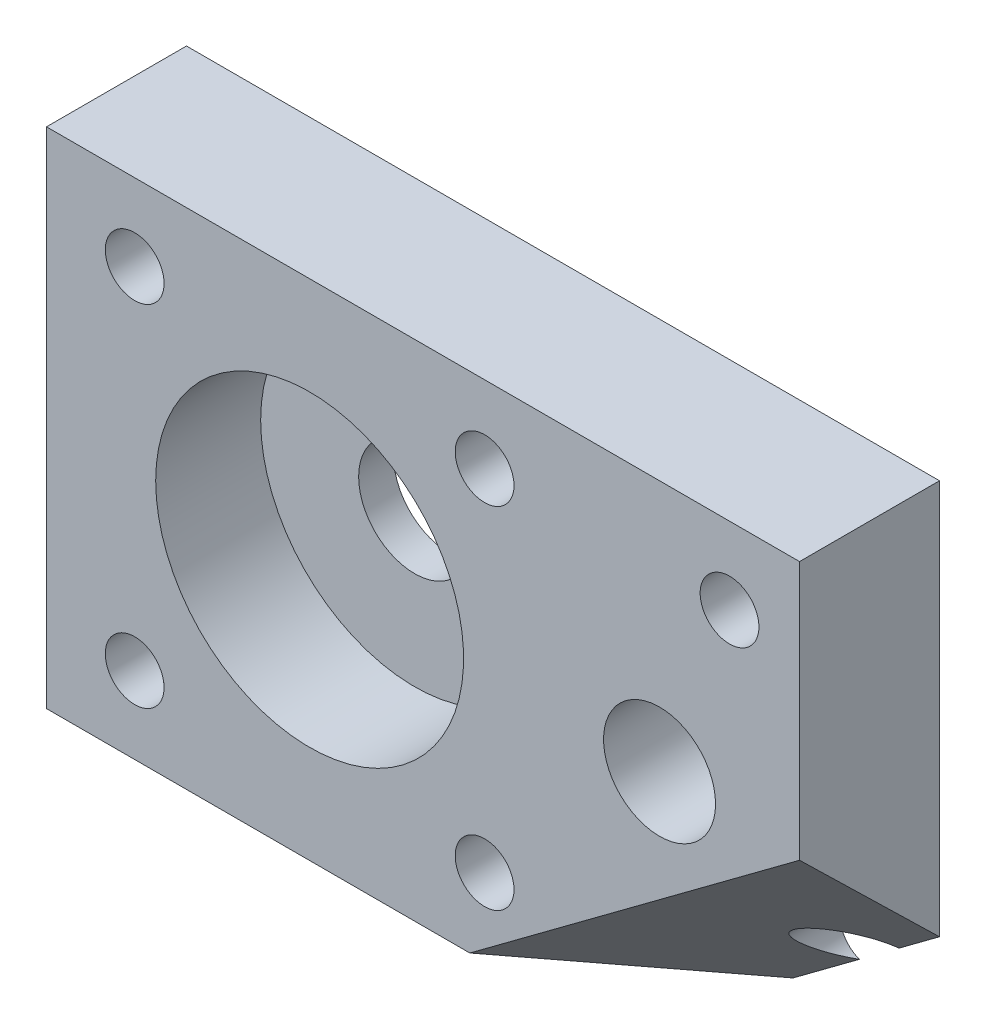
ISO-10303-21;
HEADER;
FILE_DESCRIPTION(('STEP AP214'),'2;1');
FILE_NAME('part.step','',(''),(''),'','','');
FILE_SCHEMA(('AUTOMOTIVE_DESIGN { 1 0 10303 214 1 1 1 1 }'));
ENDSEC;
DATA;
#1=APPLICATION_CONTEXT('core data for automotive mechanical design processes');
#2=APPLICATION_PROTOCOL_DEFINITION('international standard','automotive_design',2000,#1);
#3=PRODUCT_CONTEXT('',#1,'mechanical');
#4=PRODUCT('Part','Part','',(#3));
#5=PRODUCT_RELATED_PRODUCT_CATEGORY('part','',(#4));
#6=PRODUCT_DEFINITION_FORMATION('','',#4);
#7=PRODUCT_DEFINITION_CONTEXT('part definition',#1,'design');
#8=PRODUCT_DEFINITION('design','',#6,#7);
#9=PRODUCT_DEFINITION_SHAPE('','',#8);
#10=(LENGTH_UNIT() NAMED_UNIT(*) SI_UNIT(.MILLI.,.METRE.));
#11=(NAMED_UNIT(*) PLANE_ANGLE_UNIT() SI_UNIT($,.RADIAN.));
#12=(NAMED_UNIT(*) SI_UNIT($,.STERADIAN.) SOLID_ANGLE_UNIT());
#13=UNCERTAINTY_MEASURE_WITH_UNIT(LENGTH_MEASURE(1.E-05),#10,'distance_accuracy_value','');
#14=(GEOMETRIC_REPRESENTATION_CONTEXT(3) GLOBAL_UNCERTAINTY_ASSIGNED_CONTEXT((#13)) GLOBAL_UNIT_ASSIGNED_CONTEXT((#10,
#11,#12)) REPRESENTATION_CONTEXT('',''));
#15=CARTESIAN_POINT('',(0.,0.,0.));
#16=DIRECTION('',(0.,0.,1.));
#17=DIRECTION('',(1.,0.,0.));
#18=AXIS2_PLACEMENT_3D('',#15,#16,#17);
#19=CARTESIAN_POINT('',(0.,0.,-10.));
#20=DIRECTION('',(0.,0.,-1.));
#21=DIRECTION('',(1.,0.,0.));
#22=AXIS2_PLACEMENT_3D('',#19,#20,#21);
#23=PLANE('',#22);
#24=DIRECTION('',(0.802434050763534,0.596740809879152,0.));
#25=VECTOR('',#24,1.);
#26=CARTESIAN_POINT('',(-4.68452105792326,6.29924943319645,-10.));
#27=LINE('',#26,#25);
#28=CARTESIAN_POINT('',(-10.4656978784281,2.,-10.));
#29=VERTEX_POINT('',#28);
#30=CARTESIAN_POINT('',(-5.72172705219318,5.52791732877839,-10.));
#31=VERTEX_POINT('',#30);
#32=EDGE_CURVE('E85',#29,#31,#27,.T.);
#33=ORIENTED_EDGE('',*,*,#32,.F.);
#34=DIRECTION('',(-1.,0.,0.));
#35=VECTOR('',#34,1.);
#36=CARTESIAN_POINT('',(0.,2.,-10.));
#37=LINE('',#36,#35);
#38=CARTESIAN_POINT('',(-53.8,2.,-10.));
#39=VERTEX_POINT('',#38);
#40=EDGE_CURVE('E95',#29,#39,#37,.T.);
#41=ORIENTED_EDGE('',*,*,#40,.T.);
#42=DIRECTION('',(0.,-1.,0.));
#43=VECTOR('',#42,1.);
#44=CARTESIAN_POINT('',(-53.8,0.,-10.));
#45=LINE('',#44,#43);
#46=CARTESIAN_POINT('',(-53.8,38.,-10.));
#47=VERTEX_POINT('',#46);
#48=EDGE_CURVE('E41',#47,#39,#45,.T.);
#49=ORIENTED_EDGE('',*,*,#48,.F.);
#50=DIRECTION('',(1.,0.,0.));
#51=VECTOR('',#50,1.);
#52=CARTESIAN_POINT('',(-53.8,38.,-10.));
#53=LINE('',#52,#51);
#54=CARTESIAN_POINT('',(0.,38.,-10.));
#55=VERTEX_POINT('',#54);
#56=EDGE_CURVE('E235',#47,#55,#53,.T.);
#57=ORIENTED_EDGE('',*,*,#56,.T.);
#58=DIRECTION('',(0.,1.,0.));
#59=VECTOR('',#58,1.);
#60=CARTESIAN_POINT('',(0.,0.,-10.));
#61=LINE('',#60,#59);
#62=CARTESIAN_POINT('',(0.,9.78295614696457,-10.));
#63=VERTEX_POINT('',#62);
#64=EDGE_CURVE('E153',#63,#55,#61,.T.);
#65=ORIENTED_EDGE('',*,*,#64,.F.);
#66=CARTESIAN_POINT('',(-2.90364194199249,7.6236239969705,-10.));
#67=VERTEX_POINT('',#66);
#68=EDGE_CURVE('E102',#67,#63,#27,.T.);
#69=ORIENTED_EDGE('',*,*,#68,.F.);
#70=CARTESIAN_POINT('',(-5.,7.49999999999999,-10.));
#71=DIRECTION('',(0.,0.,1.));
#72=DIRECTION('',(-1.,0.,0.));
#73=AXIS2_PLACEMENT_3D('',#70,#71,#72);
#74=CIRCLE('',#73,2.1);
#75=EDGE_CURVE('E99',#67,#31,#74,.T.);
#76=ORIENTED_EDGE('',*,*,#75,.T.);
#77=EDGE_LOOP('',(#33,#41,#49,#57,#65,#69,#76));
#78=FACE_BOUND('',#77,.T.);
#79=CARTESIAN_POINT('',(-9.99999999999931,20.,-10.));
#80=DIRECTION('',(0.,0.,1.));
#81=DIRECTION('',(1.,0.,0.));
#82=AXIS2_PLACEMENT_3D('',#79,#80,#81);
#83=CIRCLE('',#82,3.99999999999931);
#84=CARTESIAN_POINT('',(-6.,20.,-10.));
#85=VERTEX_POINT('',#84);
#86=EDGE_CURVE('E222',#85,#85,#83,.T.);
#87=ORIENTED_EDGE('',*,*,#86,.T.);
#88=EDGE_LOOP('',(#87));
#89=FACE_BOUND('',#88,.T.);
#90=CARTESIAN_POINT('',(-22.5,7.5,-10.));
#91=DIRECTION('',(0.,0.,1.));
#92=DIRECTION('',(1.,0.,0.));
#93=AXIS2_PLACEMENT_3D('',#90,#91,#92);
#94=CIRCLE('',#93,2.1);
#95=CARTESIAN_POINT('',(-20.4,7.5,-10.));
#96=VERTEX_POINT('',#95);
#97=EDGE_CURVE('E129',#96,#96,#94,.T.);
#98=ORIENTED_EDGE('',*,*,#97,.T.);
#99=EDGE_LOOP('',(#98));
#100=FACE_BOUND('',#99,.T.);
#101=CARTESIAN_POINT('',(-47.5,7.49999999999998,-10.));
#102=DIRECTION('',(0.,0.,1.));
#103=DIRECTION('',(-1.,0.,0.));
#104=AXIS2_PLACEMENT_3D('',#101,#102,#103);
#105=CIRCLE('',#104,2.1);
#106=CARTESIAN_POINT('',(-49.6,7.49999999999998,-10.));
#107=VERTEX_POINT('',#106);
#108=EDGE_CURVE('E141',#107,#107,#105,.T.);
#109=ORIENTED_EDGE('',*,*,#108,.T.);
#110=EDGE_LOOP('',(#109));
#111=FACE_BOUND('',#110,.T.);
#112=CARTESIAN_POINT('',(-22.5,32.5,-10.));
#113=DIRECTION('',(0.,0.,1.));
#114=DIRECTION('',(1.,0.,0.));
#115=AXIS2_PLACEMENT_3D('',#112,#113,#114);
#116=CIRCLE('',#115,2.1);
#117=CARTESIAN_POINT('',(-20.4,32.5,-10.));
#118=VERTEX_POINT('',#117);
#119=EDGE_CURVE('E147',#118,#118,#116,.T.);
#120=ORIENTED_EDGE('',*,*,#119,.T.);
#121=EDGE_LOOP('',(#120));
#122=FACE_BOUND('',#121,.T.);
#123=CARTESIAN_POINT('',(-47.5,32.5,-10.));
#124=DIRECTION('',(0.,0.,1.));
#125=DIRECTION('',(1.,0.,0.));
#126=AXIS2_PLACEMENT_3D('',#123,#124,#125);
#127=CIRCLE('',#126,2.1);
#128=CARTESIAN_POINT('',(-45.4,32.5,-10.));
#129=VERTEX_POINT('',#128);
#130=EDGE_CURVE('E135',#129,#129,#127,.T.);
#131=ORIENTED_EDGE('',*,*,#130,.T.);
#132=EDGE_LOOP('',(#131));
#133=FACE_BOUND('',#132,.T.);
#134=CARTESIAN_POINT('',(-5.,32.5,-10.));
#135=DIRECTION('',(0.,0.,1.));
#136=DIRECTION('',(1.,0.,0.));
#137=AXIS2_PLACEMENT_3D('',#134,#135,#136);
#138=CIRCLE('',#137,2.1);
#139=CARTESIAN_POINT('',(-2.9,32.5,-10.));
#140=VERTEX_POINT('',#139);
#141=EDGE_CURVE('E123',#140,#140,#138,.T.);
#142=ORIENTED_EDGE('',*,*,#141,.T.);
#143=EDGE_LOOP('',(#142));
#144=FACE_BOUND('',#143,.T.);
#145=CARTESIAN_POINT('',(-35.,20.,-10.));
#146=DIRECTION('',(0.,0.,1.));
#147=DIRECTION('',(1.,0.,0.));
#148=AXIS2_PLACEMENT_3D('',#145,#146,#147);
#149=CIRCLE('',#148,4.);
#150=CARTESIAN_POINT('',(-31.,20.,-10.));
#151=VERTEX_POINT('',#150);
#152=EDGE_CURVE('E118',#151,#151,#149,.T.);
#153=ORIENTED_EDGE('',*,*,#152,.T.);
#154=EDGE_LOOP('',(#153));
#155=FACE_BOUND('',#154,.T.);
#156=ADVANCED_FACE('F33',(#78,#89,#100,#111,#122,#133,#144,#155),#23,.T.);
#157=CARTESIAN_POINT('',(0.,0.,0.));
#158=DIRECTION('',(0.,0.,-1.));
#159=DIRECTION('',(1.,0.,0.));
#160=AXIS2_PLACEMENT_3D('',#157,#158,#159);
#161=PLANE('',#160);
#162=CARTESIAN_POINT('',(-9.99999999999931,20.,0.));
#163=DIRECTION('',(0.,0.,1.));
#164=DIRECTION('',(1.,0.,0.));
#165=AXIS2_PLACEMENT_3D('',#162,#163,#164);
#166=CIRCLE('',#165,3.99999999999931);
#167=CARTESIAN_POINT('',(-6.,20.,0.));
#168=VERTEX_POINT('',#167);
#169=EDGE_CURVE('E226',#168,#168,#166,.T.);
#170=ORIENTED_EDGE('',*,*,#169,.F.);
#171=EDGE_LOOP('',(#170));
#172=FACE_BOUND('',#171,.T.);
#173=CARTESIAN_POINT('',(-34.9999999999993,19.9999999999776,0.));
#174=DIRECTION('',(0.,0.,-1.));
#175=DIRECTION('',(-1.,0.,0.));
#176=AXIS2_PLACEMENT_3D('',#173,#174,#175);
#177=CIRCLE('',#176,11.0000000000071);
#178=CARTESIAN_POINT('',(-46.0000000000064,19.9999999999776,0.));
#179=VERTEX_POINT('',#178);
#180=EDGE_CURVE('E106',#179,#179,#177,.T.);
#181=ORIENTED_EDGE('',*,*,#180,.T.);
#182=EDGE_LOOP('',(#181));
#183=FACE_BOUND('',#182,.T.);
#184=CARTESIAN_POINT('',(-22.5,32.5,0.));
#185=DIRECTION('',(0.,0.,1.));
#186=DIRECTION('',(1.,0.,0.));
#187=AXIS2_PLACEMENT_3D('',#184,#185,#186);
#188=CIRCLE('',#187,2.1);
#189=CARTESIAN_POINT('',(-20.4,32.5,0.));
#190=VERTEX_POINT('',#189);
#191=EDGE_CURVE('E144',#190,#190,#188,.T.);
#192=ORIENTED_EDGE('',*,*,#191,.F.);
#193=EDGE_LOOP('',(#192));
#194=FACE_BOUND('',#193,.T.);
#195=CARTESIAN_POINT('',(-47.5,7.49999999999998,0.));
#196=DIRECTION('',(0.,0.,1.));
#197=DIRECTION('',(-1.,0.,0.));
#198=AXIS2_PLACEMENT_3D('',#195,#196,#197);
#199=CIRCLE('',#198,2.1);
#200=CARTESIAN_POINT('',(-49.6,7.49999999999998,0.));
#201=VERTEX_POINT('',#200);
#202=EDGE_CURVE('E138',#201,#201,#199,.T.);
#203=ORIENTED_EDGE('',*,*,#202,.F.);
#204=EDGE_LOOP('',(#203));
#205=FACE_BOUND('',#204,.T.);
#206=CARTESIAN_POINT('',(-47.5,32.5,0.));
#207=DIRECTION('',(0.,0.,1.));
#208=DIRECTION('',(1.,0.,0.));
#209=AXIS2_PLACEMENT_3D('',#206,#207,#208);
#210=CIRCLE('',#209,2.1);
#211=CARTESIAN_POINT('',(-45.4,32.5,0.));
#212=VERTEX_POINT('',#211);
#213=EDGE_CURVE('E132',#212,#212,#210,.T.);
#214=ORIENTED_EDGE('',*,*,#213,.F.);
#215=EDGE_LOOP('',(#214));
#216=FACE_BOUND('',#215,.T.);
#217=CARTESIAN_POINT('',(-22.5,7.5,0.));
#218=DIRECTION('',(0.,0.,1.));
#219=DIRECTION('',(1.,0.,0.));
#220=AXIS2_PLACEMENT_3D('',#217,#218,#219);
#221=CIRCLE('',#220,2.1);
#222=CARTESIAN_POINT('',(-20.4,7.5,0.));
#223=VERTEX_POINT('',#222);
#224=EDGE_CURVE('E126',#223,#223,#221,.T.);
#225=ORIENTED_EDGE('',*,*,#224,.F.);
#226=EDGE_LOOP('',(#225));
#227=FACE_BOUND('',#226,.T.);
#228=CARTESIAN_POINT('',(-5.,32.5,0.));
#229=DIRECTION('',(0.,0.,1.));
#230=DIRECTION('',(1.,0.,0.));
#231=AXIS2_PLACEMENT_3D('',#228,#229,#230);
#232=CIRCLE('',#231,2.1);
#233=CARTESIAN_POINT('',(-2.9,32.5,0.));
#234=VERTEX_POINT('',#233);
#235=EDGE_CURVE('E122',#234,#234,#232,.T.);
#236=ORIENTED_EDGE('',*,*,#235,.F.);
#237=EDGE_LOOP('',(#236));
#238=FACE_BOUND('',#237,.T.);
#239=DIRECTION('',(1.,0.,0.));
#240=VECTOR('',#239,1.);
#241=CARTESIAN_POINT('',(-53.8,2.,0.));
#242=LINE('',#241,#240);
#243=CARTESIAN_POINT('',(-53.8,2.,0.));
#244=VERTEX_POINT('',#243);
#245=CARTESIAN_POINT('',(-23.5582434790037,2.,0.));
#246=VERTEX_POINT('',#245);
#247=EDGE_CURVE('E107',#244,#246,#242,.T.);
#248=ORIENTED_EDGE('',*,*,#247,.T.);
#249=DIRECTION('',(0.802434050763534,0.596740809879152,0.));
#250=VECTOR('',#249,1.);
#251=CARTESIAN_POINT('',(-9.34677123300887,12.5685513340076,0.));
#252=LINE('',#251,#250);
#253=CARTESIAN_POINT('',(0.,19.5194027217742,0.));
#254=VERTEX_POINT('',#253);
#255=EDGE_CURVE('E47',#246,#254,#252,.T.);
#256=ORIENTED_EDGE('',*,*,#255,.T.);
#257=DIRECTION('',(0.,1.,0.));
#258=VECTOR('',#257,1.);
#259=CARTESIAN_POINT('',(0.,0.,0.));
#260=LINE('',#259,#258);
#261=CARTESIAN_POINT('',(0.,38.,0.));
#262=VERTEX_POINT('',#261);
#263=EDGE_CURVE('E150',#254,#262,#260,.T.);
#264=ORIENTED_EDGE('',*,*,#263,.T.);
#265=DIRECTION('',(-1.,0.,0.));
#266=VECTOR('',#265,1.);
#267=CARTESIAN_POINT('',(0.,38.,0.));
#268=LINE('',#267,#266);
#269=CARTESIAN_POINT('',(-53.8,38.,0.));
#270=VERTEX_POINT('',#269);
#271=EDGE_CURVE('E231',#262,#270,#268,.T.);
#272=ORIENTED_EDGE('',*,*,#271,.T.);
#273=DIRECTION('',(0.,-1.,0.));
#274=VECTOR('',#273,1.);
#275=CARTESIAN_POINT('',(-53.8,0.,0.));
#276=LINE('',#275,#274);
#277=EDGE_CURVE('E155',#270,#244,#276,.T.);
#278=ORIENTED_EDGE('',*,*,#277,.T.);
#279=EDGE_LOOP('',(#248,#256,#264,#272,#278));
#280=FACE_BOUND('',#279,.T.);
#281=ADVANCED_FACE('F183',(#172,#183,#194,#205,#216,#227,#238,#280),#161,.F.);
#282=CARTESIAN_POINT('',(0.,0.,-10.));
#283=DIRECTION('',(-1.,0.,0.));
#284=DIRECTION('',(0.,0.,-1.));
#285=AXIS2_PLACEMENT_3D('',#282,#283,#284);
#286=PLANE('',#285);
#287=ORIENTED_EDGE('',*,*,#263,.F.);
#288=DIRECTION('',(0.,-0.6976021356335,-0.716485352508744));
#289=VECTOR('',#288,1.);
#290=CARTESIAN_POINT('',(0.,5.02209286808676,-14.8897338903859));
#291=LINE('',#290,#289);
#292=EDGE_CURVE('E216',#254,#63,#291,.T.);
#293=ORIENTED_EDGE('',*,*,#292,.T.);
#294=ORIENTED_EDGE('',*,*,#64,.T.);
#295=DIRECTION('',(0.,0.,1.));
#296=VECTOR('',#295,1.);
#297=CARTESIAN_POINT('',(0.,38.,-10.));
#298=LINE('',#297,#296);
#299=EDGE_CURVE('E225',#55,#262,#298,.T.);
#300=ORIENTED_EDGE('',*,*,#299,.T.);
#301=EDGE_LOOP('',(#287,#293,#294,#300));
#302=FACE_BOUND('',#301,.T.);
#303=ADVANCED_FACE('F35',(#302),#286,.F.);
#304=CARTESIAN_POINT('',(-53.8,0.,-10.));
#305=DIRECTION('',(1.,0.,0.));
#306=DIRECTION('',(0.,0.,1.));
#307=AXIS2_PLACEMENT_3D('',#304,#305,#306);
#308=PLANE('',#307);
#309=DIRECTION('',(0.,0.,-1.));
#310=VECTOR('',#309,1.);
#311=CARTESIAN_POINT('',(-53.8,38.,0.));
#312=LINE('',#311,#310);
#313=EDGE_CURVE('E55',#270,#47,#312,.T.);
#314=ORIENTED_EDGE('',*,*,#313,.T.);
#315=ORIENTED_EDGE('',*,*,#48,.T.);
#316=DIRECTION('',(0.,0.,1.));
#317=VECTOR('',#316,1.);
#318=CARTESIAN_POINT('',(-53.8,2.,-10.));
#319=LINE('',#318,#317);
#320=EDGE_CURVE('E104',#39,#244,#319,.T.);
#321=ORIENTED_EDGE('',*,*,#320,.T.);
#322=ORIENTED_EDGE('',*,*,#277,.F.);
#323=EDGE_LOOP('',(#314,#315,#321,#322));
#324=FACE_BOUND('',#323,.T.);
#325=ADVANCED_FACE('F168',(#324),#308,.F.);
#326=CARTESIAN_POINT('',(-35.,20.,-10.));
#327=DIRECTION('',(0.,0.,1.));
#328=DIRECTION('',(-1.,0.,0.));
#329=AXIS2_PLACEMENT_3D('',#326,#327,#328);
#330=CYLINDRICAL_SURFACE('',#329,4.);
#331=ORIENTED_EDGE('',*,*,#152,.F.);
#332=EDGE_LOOP('',(#331));
#333=FACE_BOUND('',#332,.T.);
#334=CARTESIAN_POINT('',(-35.,20.,-7.5));
#335=DIRECTION('',(0.,0.,-1.));
#336=DIRECTION('',(-1.,0.,0.));
#337=AXIS2_PLACEMENT_3D('',#334,#335,#336);
#338=CIRCLE('',#337,4.);
#339=CARTESIAN_POINT('',(-39.,20.,-7.5));
#340=VERTEX_POINT('',#339);
#341=EDGE_CURVE('E116',#340,#340,#338,.T.);
#342=ORIENTED_EDGE('',*,*,#341,.F.);
#343=EDGE_LOOP('',(#342));
#344=FACE_BOUND('',#343,.T.);
#345=ADVANCED_FACE('F165',(#333,#344),#330,.F.);
#346=CARTESIAN_POINT('',(-22.5,32.5,-10.));
#347=DIRECTION('',(0.,0.,1.));
#348=DIRECTION('',(-1.,0.,0.));
#349=AXIS2_PLACEMENT_3D('',#346,#347,#348);
#350=CYLINDRICAL_SURFACE('',#349,2.1);
#351=ORIENTED_EDGE('',*,*,#119,.F.);
#352=EDGE_LOOP('',(#351));
#353=FACE_BOUND('',#352,.T.);
#354=ORIENTED_EDGE('',*,*,#191,.T.);
#355=EDGE_LOOP('',(#354));
#356=FACE_BOUND('',#355,.T.);
#357=ADVANCED_FACE('F167',(#353,#356),#350,.F.);
#358=CARTESIAN_POINT('',(-47.5,7.49999999999998,-10.));
#359=DIRECTION('',(0.,0.,1.));
#360=DIRECTION('',(-1.,0.,0.));
#361=AXIS2_PLACEMENT_3D('',#358,#359,#360);
#362=CYLINDRICAL_SURFACE('',#361,2.1);
#363=ORIENTED_EDGE('',*,*,#108,.F.);
#364=EDGE_LOOP('',(#363));
#365=FACE_BOUND('',#364,.T.);
#366=ORIENTED_EDGE('',*,*,#202,.T.);
#367=EDGE_LOOP('',(#366));
#368=FACE_BOUND('',#367,.T.);
#369=ADVANCED_FACE('F175',(#365,#368),#362,.F.);
#370=CARTESIAN_POINT('',(-47.5,32.5,-10.));
#371=DIRECTION('',(0.,0.,1.));
#372=DIRECTION('',(-1.,0.,0.));
#373=AXIS2_PLACEMENT_3D('',#370,#371,#372);
#374=CYLINDRICAL_SURFACE('',#373,2.1);
#375=ORIENTED_EDGE('',*,*,#130,.F.);
#376=EDGE_LOOP('',(#375));
#377=FACE_BOUND('',#376,.T.);
#378=ORIENTED_EDGE('',*,*,#213,.T.);
#379=EDGE_LOOP('',(#378));
#380=FACE_BOUND('',#379,.T.);
#381=ADVANCED_FACE('F194',(#377,#380),#374,.F.);
#382=CARTESIAN_POINT('',(-22.5,7.5,-10.));
#383=DIRECTION('',(0.,0.,1.));
#384=DIRECTION('',(-1.,0.,0.));
#385=AXIS2_PLACEMENT_3D('',#382,#383,#384);
#386=CYLINDRICAL_SURFACE('',#385,2.1);
#387=ORIENTED_EDGE('',*,*,#97,.F.);
#388=EDGE_LOOP('',(#387));
#389=FACE_BOUND('',#388,.T.);
#390=ORIENTED_EDGE('',*,*,#224,.T.);
#391=EDGE_LOOP('',(#390));
#392=FACE_BOUND('',#391,.T.);
#393=ADVANCED_FACE('F198',(#389,#392),#386,.F.);
#394=CARTESIAN_POINT('',(-5.,32.5,-10.));
#395=DIRECTION('',(0.,0.,1.));
#396=DIRECTION('',(-1.,0.,0.));
#397=AXIS2_PLACEMENT_3D('',#394,#395,#396);
#398=CYLINDRICAL_SURFACE('',#397,2.1);
#399=ORIENTED_EDGE('',*,*,#141,.F.);
#400=EDGE_LOOP('',(#399));
#401=FACE_BOUND('',#400,.T.);
#402=ORIENTED_EDGE('',*,*,#235,.T.);
#403=EDGE_LOOP('',(#402));
#404=FACE_BOUND('',#403,.T.);
#405=ADVANCED_FACE('F202',(#401,#404),#398,.F.);
#406=CARTESIAN_POINT('',(-5.,7.49999999999999,-10.));
#407=DIRECTION('',(0.,0.,1.));
#408=DIRECTION('',(-1.,0.,0.));
#409=AXIS2_PLACEMENT_3D('',#406,#407,#408);
#410=CYLINDRICAL_SURFACE('',#409,2.1);
#411=CARTESIAN_POINT('',(-5.,7.49999999999999,-8.52578588214747));
#412=DIRECTION('',(-0.470238175300756,0.632326661061866,-0.615661475325659));
#413=DIRECTION('',(-0.367390327397227,0.494027731544622,0.788010753606721));
#414=AXIS2_PLACEMENT_3D('',#411,#412,#413);
#415=ELLIPSE('',#414,3.41096541551375,2.1);
#416=EDGE_CURVE('E100',#31,#67,#415,.T.);
#417=ORIENTED_EDGE('',*,*,#416,.F.);
#418=ORIENTED_EDGE('',*,*,#75,.F.);
#419=EDGE_LOOP('',(#417,#418));
#420=FACE_BOUND('',#419,.T.);
#421=ADVANCED_FACE('F205',(#420),#410,.F.);
#422=CARTESIAN_POINT('',(-34.9999999999993,19.9999999999776,-7.5));
#423=DIRECTION('',(0.,0.,1.));
#424=DIRECTION('',(-1.,0.,0.));
#425=AXIS2_PLACEMENT_3D('',#422,#423,#424);
#426=CYLINDRICAL_SURFACE('',#425,11.0000000000071);
#427=CARTESIAN_POINT('',(-34.9999999999993,19.9999999999776,-7.5));
#428=DIRECTION('',(0.,0.,-1.));
#429=DIRECTION('',(-1.,0.,0.));
#430=AXIS2_PLACEMENT_3D('',#427,#428,#429);
#431=CIRCLE('',#430,11.0000000000071);
#432=CARTESIAN_POINT('',(-46.0000000000064,19.9999999999776,-7.5));
#433=VERTEX_POINT('',#432);
#434=EDGE_CURVE('E110',#433,#433,#431,.T.);
#435=ORIENTED_EDGE('',*,*,#434,.T.);
#436=EDGE_LOOP('',(#435));
#437=FACE_BOUND('',#436,.T.);
#438=ORIENTED_EDGE('',*,*,#180,.F.);
#439=EDGE_LOOP('',(#438));
#440=FACE_BOUND('',#439,.T.);
#441=ADVANCED_FACE('F208',(#437,#440),#426,.F.);
#442=CARTESIAN_POINT('',(-34.9999999999993,19.9999999999776,-7.5));
#443=DIRECTION('',(0.,0.,1.));
#444=DIRECTION('',(-1.,0.,0.));
#445=AXIS2_PLACEMENT_3D('',#442,#443,#444);
#446=PLANE('',#445);
#447=ORIENTED_EDGE('',*,*,#341,.T.);
#448=EDGE_LOOP('',(#447));
#449=FACE_BOUND('',#448,.T.);
#450=ORIENTED_EDGE('',*,*,#434,.F.);
#451=EDGE_LOOP('',(#450));
#452=FACE_BOUND('',#451,.T.);
#453=ADVANCED_FACE('F162',(#449,#452),#446,.T.);
#454=CARTESIAN_POINT('',(0.,2.,0.));
#455=DIRECTION('',(0.,-1.,0.));
#456=DIRECTION('',(0.,0.,1.));
#457=AXIS2_PLACEMENT_3D('',#454,#455,#456);
#458=PLANE('',#457);
#459=DIRECTION('',(0.794707610657393,0.,-0.606992432871463));
#460=VECTOR('',#459,1.);
#461=CARTESIAN_POINT('',(-8.679794835281,2.,-11.3640609684557));
#462=LINE('',#461,#460);
#463=EDGE_CURVE('E11',#246,#29,#462,.T.);
#464=ORIENTED_EDGE('',*,*,#463,.F.);
#465=ORIENTED_EDGE('',*,*,#247,.F.);
#466=ORIENTED_EDGE('',*,*,#320,.F.);
#467=ORIENTED_EDGE('',*,*,#40,.F.);
#468=EDGE_LOOP('',(#464,#465,#466,#467));
#469=FACE_BOUND('',#468,.T.);
#470=ADVANCED_FACE('F103',(#469),#458,.T.);
#471=CARTESIAN_POINT('',(0.,38.,0.));
#472=DIRECTION('',(0.,1.,0.));
#473=DIRECTION('',(-1.,0.,0.));
#474=AXIS2_PLACEMENT_3D('',#471,#472,#473);
#475=PLANE('',#474);
#476=ORIENTED_EDGE('',*,*,#299,.F.);
#477=ORIENTED_EDGE('',*,*,#56,.F.);
#478=ORIENTED_EDGE('',*,*,#313,.F.);
#479=ORIENTED_EDGE('',*,*,#271,.F.);
#480=EDGE_LOOP('',(#476,#477,#478,#479));
#481=FACE_BOUND('',#480,.T.);
#482=ADVANCED_FACE('F240',(#481),#475,.T.);
#483=CARTESIAN_POINT('',(-9.99999999999931,20.,-10.));
#484=DIRECTION('',(0.,0.,1.));
#485=DIRECTION('',(1.,0.,0.));
#486=AXIS2_PLACEMENT_3D('',#483,#484,#485);
#487=CYLINDRICAL_SURFACE('',#486,3.99999999999931);
#488=ORIENTED_EDGE('',*,*,#86,.F.);
#489=EDGE_LOOP('',(#488));
#490=FACE_BOUND('',#489,.T.);
#491=ORIENTED_EDGE('',*,*,#169,.T.);
#492=EDGE_LOOP('',(#491));
#493=FACE_BOUND('',#492,.T.);
#494=ADVANCED_FACE('F321',(#490,#493),#487,.F.);
#495=CARTESIAN_POINT('',(-5.8039799237174,7.8045795488362,-7.59888718160951));
#496=DIRECTION('',(-0.470238175300756,0.632326661061866,-0.615661475325659));
#497=DIRECTION('',(0.,0.6976021356335,0.716485352508744));
#498=AXIS2_PLACEMENT_3D('',#495,#496,#497);
#499=PLANE('',#498);
#500=ORIENTED_EDGE('',*,*,#68,.T.);
#501=ORIENTED_EDGE('',*,*,#292,.F.);
#502=ORIENTED_EDGE('',*,*,#255,.F.);
#503=ORIENTED_EDGE('',*,*,#463,.T.);
#504=ORIENTED_EDGE('',*,*,#32,.T.);
#505=ORIENTED_EDGE('',*,*,#416,.T.);
#506=EDGE_LOOP('',(#500,#501,#502,#503,#504,#505));
#507=FACE_BOUND('',#506,.T.);
#508=ADVANCED_FACE('F84',(#507),#499,.F.);
#509=CLOSED_SHELL('',(#156,#281,#303,#325,#345,#357,#369,#381,#393,#405,#421,#441,#453,#470,
#482,#494,#508));
#510=MANIFOLD_SOLID_BREP('B2',#509);
#511=ADVANCED_BREP_SHAPE_REPRESENTATION('',(#18,#510),#14);
#512=SHAPE_DEFINITION_REPRESENTATION(#9,#511);
ENDSEC;
END-ISO-10303-21;
